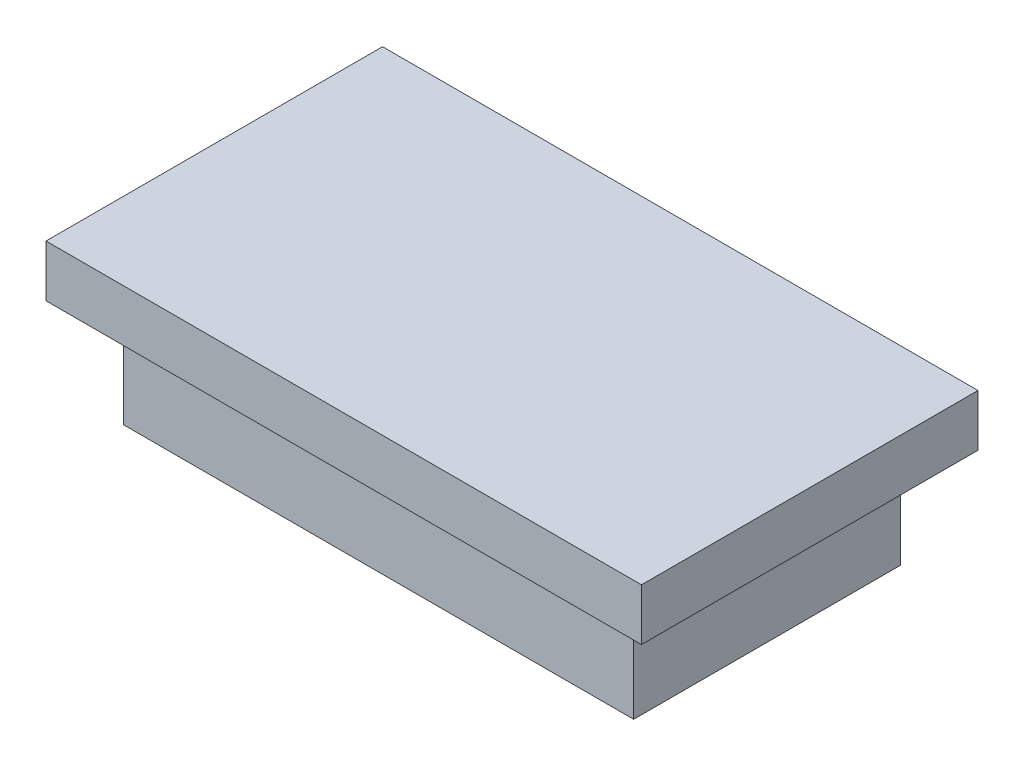
ISO-10303-21;
HEADER;
FILE_DESCRIPTION(('STEP AP214'),'2;1');
FILE_NAME('part.step','',(''),(''),'','','');
FILE_SCHEMA(('AUTOMOTIVE_DESIGN { 1 0 10303 214 1 1 1 1 }'));
ENDSEC;
DATA;
#1=APPLICATION_CONTEXT('core data for automotive mechanical design processes');
#2=APPLICATION_PROTOCOL_DEFINITION('international standard','automotive_design',2000,#1);
#3=PRODUCT_CONTEXT('',#1,'mechanical');
#4=PRODUCT('Part','Part','',(#3));
#5=PRODUCT_RELATED_PRODUCT_CATEGORY('part','',(#4));
#6=PRODUCT_DEFINITION_FORMATION('','',#4);
#7=PRODUCT_DEFINITION_CONTEXT('part definition',#1,'design');
#8=PRODUCT_DEFINITION('design','',#6,#7);
#9=PRODUCT_DEFINITION_SHAPE('','',#8);
#10=(LENGTH_UNIT() NAMED_UNIT(*) SI_UNIT(.MILLI.,.METRE.));
#11=(NAMED_UNIT(*) PLANE_ANGLE_UNIT() SI_UNIT($,.RADIAN.));
#12=(NAMED_UNIT(*) SI_UNIT($,.STERADIAN.) SOLID_ANGLE_UNIT());
#13=UNCERTAINTY_MEASURE_WITH_UNIT(LENGTH_MEASURE(1.E-05),#10,'distance_accuracy_value','');
#14=(GEOMETRIC_REPRESENTATION_CONTEXT(3) GLOBAL_UNCERTAINTY_ASSIGNED_CONTEXT((#13)) GLOBAL_UNIT_ASSIGNED_CONTEXT((#10,
#11,#12)) REPRESENTATION_CONTEXT('',''));
#15=CARTESIAN_POINT('',(0.,0.,0.));
#16=DIRECTION('',(0.,0.,1.));
#17=DIRECTION('',(1.,0.,0.));
#18=AXIS2_PLACEMENT_3D('',#15,#16,#17);
#19=CARTESIAN_POINT('',(-9.85,4.,5.15));
#20=DIRECTION('',(1.,0.,0.));
#21=DIRECTION('',(0.,0.,-1.));
#22=AXIS2_PLACEMENT_3D('',#19,#20,#21);
#23=PLANE('',#22);
#24=DIRECTION('',(0.,0.,1.));
#25=VECTOR('',#24,1.);
#26=CARTESIAN_POINT('',(-9.85,0.,5.15));
#27=LINE('',#26,#25);
#28=CARTESIAN_POINT('',(-9.85,0.,-5.15));
#29=VERTEX_POINT('',#28);
#30=CARTESIAN_POINT('',(-9.85,0.,5.15));
#31=VERTEX_POINT('',#30);
#32=EDGE_CURVE('E133',#29,#31,#27,.T.);
#33=ORIENTED_EDGE('',*,*,#32,.T.);
#34=DIRECTION('',(0.,-1.,0.));
#35=VECTOR('',#34,1.);
#36=CARTESIAN_POINT('',(-9.85,4.,5.15));
#37=LINE('',#36,#35);
#38=CARTESIAN_POINT('',(-9.85,4.,5.15));
#39=VERTEX_POINT('',#38);
#40=EDGE_CURVE('E11',#39,#31,#37,.T.);
#41=ORIENTED_EDGE('',*,*,#40,.F.);
#42=DIRECTION('',(0.,0.,1.));
#43=VECTOR('',#42,1.);
#44=CARTESIAN_POINT('',(-9.85,4.,5.15));
#45=LINE('',#44,#43);
#46=CARTESIAN_POINT('',(-9.84999999999999,4.,-5.15));
#47=VERTEX_POINT('',#46);
#48=EDGE_CURVE('E142',#47,#39,#45,.T.);
#49=ORIENTED_EDGE('',*,*,#48,.F.);
#50=DIRECTION('',(0.,-1.,0.));
#51=VECTOR('',#50,1.);
#52=CARTESIAN_POINT('',(-9.85,4.,-5.15));
#53=LINE('',#52,#51);
#54=EDGE_CURVE('E151',#47,#29,#53,.T.);
#55=ORIENTED_EDGE('',*,*,#54,.T.);
#56=EDGE_LOOP('',(#33,#41,#49,#55));
#57=FACE_BOUND('',#56,.T.);
#58=ADVANCED_FACE('F35',(#57),#23,.F.);
#59=CARTESIAN_POINT('',(9.85,4.,5.15));
#60=DIRECTION('',(0.,0.,-1.));
#61=DIRECTION('',(-1.,0.,0.));
#62=AXIS2_PLACEMENT_3D('',#59,#60,#61);
#63=PLANE('',#62);
#64=DIRECTION('',(1.,0.,0.));
#65=VECTOR('',#64,1.);
#66=CARTESIAN_POINT('',(9.85,0.,5.15));
#67=LINE('',#66,#65);
#68=CARTESIAN_POINT('',(9.85,0.,5.15));
#69=VERTEX_POINT('',#68);
#70=EDGE_CURVE('E136',#31,#69,#67,.T.);
#71=ORIENTED_EDGE('',*,*,#70,.T.);
#72=DIRECTION('',(0.,-1.,0.));
#73=VECTOR('',#72,1.);
#74=CARTESIAN_POINT('',(9.85,4.,5.15));
#75=LINE('',#74,#73);
#76=CARTESIAN_POINT('',(9.85,4.,5.15));
#77=VERTEX_POINT('',#76);
#78=EDGE_CURVE('E43',#77,#69,#75,.T.);
#79=ORIENTED_EDGE('',*,*,#78,.F.);
#80=DIRECTION('',(1.,0.,0.));
#81=VECTOR('',#80,1.);
#82=CARTESIAN_POINT('',(9.85,4.,5.15));
#83=LINE('',#82,#81);
#84=EDGE_CURVE('E77',#39,#77,#83,.T.);
#85=ORIENTED_EDGE('',*,*,#84,.F.);
#86=ORIENTED_EDGE('',*,*,#40,.T.);
#87=EDGE_LOOP('',(#71,#79,#85,#86));
#88=FACE_BOUND('',#87,.T.);
#89=ADVANCED_FACE('F177',(#88),#63,.F.);
#90=CARTESIAN_POINT('',(9.85,4.,5.15));
#91=DIRECTION('',(-1.,0.,0.));
#92=DIRECTION('',(0.,0.,1.));
#93=AXIS2_PLACEMENT_3D('',#90,#91,#92);
#94=PLANE('',#93);
#95=DIRECTION('',(0.,0.,-1.));
#96=VECTOR('',#95,1.);
#97=CARTESIAN_POINT('',(9.85,0.,5.15));
#98=LINE('',#97,#96);
#99=CARTESIAN_POINT('',(9.85,0.,-5.15));
#100=VERTEX_POINT('',#99);
#101=EDGE_CURVE('E67',#69,#100,#98,.T.);
#102=ORIENTED_EDGE('',*,*,#101,.T.);
#103=DIRECTION('',(0.,-1.,0.));
#104=VECTOR('',#103,1.);
#105=CARTESIAN_POINT('',(9.85,4.,-5.15));
#106=LINE('',#105,#104);
#107=CARTESIAN_POINT('',(9.85,4.,-5.15));
#108=VERTEX_POINT('',#107);
#109=EDGE_CURVE('E51',#108,#100,#106,.T.);
#110=ORIENTED_EDGE('',*,*,#109,.F.);
#111=DIRECTION('',(0.,0.,-1.));
#112=VECTOR('',#111,1.);
#113=CARTESIAN_POINT('',(9.85,4.,5.15));
#114=LINE('',#113,#112);
#115=EDGE_CURVE('E146',#77,#108,#114,.T.);
#116=ORIENTED_EDGE('',*,*,#115,.F.);
#117=ORIENTED_EDGE('',*,*,#78,.T.);
#118=EDGE_LOOP('',(#102,#110,#116,#117));
#119=FACE_BOUND('',#118,.T.);
#120=ADVANCED_FACE('F157',(#119),#94,.F.);
#121=CARTESIAN_POINT('',(9.85,4.,-5.15));
#122=DIRECTION('',(0.,0.,1.));
#123=DIRECTION('',(1.,0.,0.));
#124=AXIS2_PLACEMENT_3D('',#121,#122,#123);
#125=PLANE('',#124);
#126=DIRECTION('',(-1.,0.,0.));
#127=VECTOR('',#126,1.);
#128=CARTESIAN_POINT('',(9.85,0.,-5.15));
#129=LINE('',#128,#127);
#130=EDGE_CURVE('E72',#100,#29,#129,.T.);
#131=ORIENTED_EDGE('',*,*,#130,.T.);
#132=ORIENTED_EDGE('',*,*,#54,.F.);
#133=DIRECTION('',(-1.,0.,0.));
#134=VECTOR('',#133,1.);
#135=CARTESIAN_POINT('',(9.85,4.,-5.15));
#136=LINE('',#135,#134);
#137=EDGE_CURVE('E149',#108,#47,#136,.T.);
#138=ORIENTED_EDGE('',*,*,#137,.F.);
#139=ORIENTED_EDGE('',*,*,#109,.T.);
#140=EDGE_LOOP('',(#131,#132,#138,#139));
#141=FACE_BOUND('',#140,.T.);
#142=ADVANCED_FACE('F162',(#141),#125,.F.);
#143=CARTESIAN_POINT('',(0.,0.,0.));
#144=DIRECTION('',(0.,1.,0.));
#145=DIRECTION('',(0.,0.,1.));
#146=AXIS2_PLACEMENT_3D('',#143,#144,#145);
#147=PLANE('',#146);
#148=ORIENTED_EDGE('',*,*,#32,.F.);
#149=ORIENTED_EDGE('',*,*,#130,.F.);
#150=ORIENTED_EDGE('',*,*,#101,.F.);
#151=ORIENTED_EDGE('',*,*,#70,.F.);
#152=EDGE_LOOP('',(#148,#149,#150,#151));
#153=FACE_BOUND('',#152,.T.);
#154=ADVANCED_FACE('F160',(#153),#147,.F.);
#155=CARTESIAN_POINT('',(0.,4.,0.));
#156=DIRECTION('',(0.,1.,0.));
#157=DIRECTION('',(0.,0.,1.));
#158=AXIS2_PLACEMENT_3D('',#155,#156,#157);
#159=PLANE('',#158);
#160=DIRECTION('',(0.,0.,1.));
#161=VECTOR('',#160,1.);
#162=CARTESIAN_POINT('',(-11.5,4.,6.5));
#163=LINE('',#162,#161);
#164=CARTESIAN_POINT('',(-11.5,4.,-6.5));
#165=VERTEX_POINT('',#164);
#166=CARTESIAN_POINT('',(-11.5,4.,6.5));
#167=VERTEX_POINT('',#166);
#168=EDGE_CURVE('E132',#165,#167,#163,.T.);
#169=ORIENTED_EDGE('',*,*,#168,.F.);
#170=DIRECTION('',(-1.,0.,0.));
#171=VECTOR('',#170,1.);
#172=CARTESIAN_POINT('',(11.5,4.,-6.5));
#173=LINE('',#172,#171);
#174=CARTESIAN_POINT('',(11.5,4.,-6.5));
#175=VERTEX_POINT('',#174);
#176=EDGE_CURVE('E128',#175,#165,#173,.T.);
#177=ORIENTED_EDGE('',*,*,#176,.F.);
#178=DIRECTION('',(0.,0.,-1.));
#179=VECTOR('',#178,1.);
#180=CARTESIAN_POINT('',(11.5,4.,6.5));
#181=LINE('',#180,#179);
#182=CARTESIAN_POINT('',(11.5,4.,6.5));
#183=VERTEX_POINT('',#182);
#184=EDGE_CURVE('E204',#183,#175,#181,.T.);
#185=ORIENTED_EDGE('',*,*,#184,.F.);
#186=DIRECTION('',(1.,0.,0.));
#187=VECTOR('',#186,1.);
#188=CARTESIAN_POINT('',(11.5,4.,6.5));
#189=LINE('',#188,#187);
#190=EDGE_CURVE('E207',#167,#183,#189,.T.);
#191=ORIENTED_EDGE('',*,*,#190,.F.);
#192=EDGE_LOOP('',(#169,#177,#185,#191));
#193=FACE_BOUND('',#192,.T.);
#194=ORIENTED_EDGE('',*,*,#137,.T.);
#195=ORIENTED_EDGE('',*,*,#48,.T.);
#196=ORIENTED_EDGE('',*,*,#84,.T.);
#197=ORIENTED_EDGE('',*,*,#115,.T.);
#198=EDGE_LOOP('',(#194,#195,#196,#197));
#199=FACE_BOUND('',#198,.T.);
#200=ADVANCED_FACE('F164',(#193,#199),#159,.F.);
#201=CARTESIAN_POINT('',(-11.5,6.,6.5));
#202=DIRECTION('',(1.,0.,0.));
#203=DIRECTION('',(0.,0.,-1.));
#204=AXIS2_PLACEMENT_3D('',#201,#202,#203);
#205=PLANE('',#204);
#206=ORIENTED_EDGE('',*,*,#168,.T.);
#207=DIRECTION('',(0.,-1.,0.));
#208=VECTOR('',#207,1.);
#209=CARTESIAN_POINT('',(-11.5,6.,6.5));
#210=LINE('',#209,#208);
#211=CARTESIAN_POINT('',(-11.5,6.,6.5));
#212=VERTEX_POINT('',#211);
#213=EDGE_CURVE('E112',#212,#167,#210,.T.);
#214=ORIENTED_EDGE('',*,*,#213,.F.);
#215=DIRECTION('',(0.,0.,1.));
#216=VECTOR('',#215,1.);
#217=CARTESIAN_POINT('',(-11.5,6.,6.5));
#218=LINE('',#217,#216);
#219=CARTESIAN_POINT('',(-11.5,6.,-6.5));
#220=VERTEX_POINT('',#219);
#221=EDGE_CURVE('E119',#220,#212,#218,.T.);
#222=ORIENTED_EDGE('',*,*,#221,.F.);
#223=DIRECTION('',(0.,-1.,0.));
#224=VECTOR('',#223,1.);
#225=CARTESIAN_POINT('',(-11.5,6.,-6.5));
#226=LINE('',#225,#224);
#227=EDGE_CURVE('E201',#220,#165,#226,.T.);
#228=ORIENTED_EDGE('',*,*,#227,.T.);
#229=EDGE_LOOP('',(#206,#214,#222,#228));
#230=FACE_BOUND('',#229,.T.);
#231=ADVANCED_FACE('F130',(#230),#205,.F.);
#232=CARTESIAN_POINT('',(11.5,6.,6.5));
#233=DIRECTION('',(0.,0.,-1.));
#234=DIRECTION('',(-1.,0.,0.));
#235=AXIS2_PLACEMENT_3D('',#232,#233,#234);
#236=PLANE('',#235);
#237=ORIENTED_EDGE('',*,*,#190,.T.);
#238=DIRECTION('',(0.,-1.,0.));
#239=VECTOR('',#238,1.);
#240=CARTESIAN_POINT('',(11.5,6.,6.5));
#241=LINE('',#240,#239);
#242=CARTESIAN_POINT('',(11.5,6.,6.5));
#243=VERTEX_POINT('',#242);
#244=EDGE_CURVE('E115',#243,#183,#241,.T.);
#245=ORIENTED_EDGE('',*,*,#244,.F.);
#246=DIRECTION('',(1.,0.,0.));
#247=VECTOR('',#246,1.);
#248=CARTESIAN_POINT('',(11.5,6.,6.5));
#249=LINE('',#248,#247);
#250=EDGE_CURVE('E108',#212,#243,#249,.T.);
#251=ORIENTED_EDGE('',*,*,#250,.F.);
#252=ORIENTED_EDGE('',*,*,#213,.T.);
#253=EDGE_LOOP('',(#237,#245,#251,#252));
#254=FACE_BOUND('',#253,.T.);
#255=ADVANCED_FACE('F110',(#254),#236,.F.);
#256=CARTESIAN_POINT('',(11.5,6.,6.5));
#257=DIRECTION('',(-1.,0.,0.));
#258=DIRECTION('',(0.,0.,1.));
#259=AXIS2_PLACEMENT_3D('',#256,#257,#258);
#260=PLANE('',#259);
#261=ORIENTED_EDGE('',*,*,#184,.T.);
#262=DIRECTION('',(0.,-1.,0.));
#263=VECTOR('',#262,1.);
#264=CARTESIAN_POINT('',(11.5,6.,-6.5));
#265=LINE('',#264,#263);
#266=CARTESIAN_POINT('',(11.5,6.,-6.5));
#267=VERTEX_POINT('',#266);
#268=EDGE_CURVE('E138',#267,#175,#265,.T.);
#269=ORIENTED_EDGE('',*,*,#268,.F.);
#270=DIRECTION('',(0.,0.,-1.));
#271=VECTOR('',#270,1.);
#272=CARTESIAN_POINT('',(11.5,6.,6.5));
#273=LINE('',#272,#271);
#274=EDGE_CURVE('E118',#243,#267,#273,.T.);
#275=ORIENTED_EDGE('',*,*,#274,.F.);
#276=ORIENTED_EDGE('',*,*,#244,.T.);
#277=EDGE_LOOP('',(#261,#269,#275,#276));
#278=FACE_BOUND('',#277,.T.);
#279=ADVANCED_FACE('F190',(#278),#260,.F.);
#280=CARTESIAN_POINT('',(11.5,6.,-6.5));
#281=DIRECTION('',(0.,0.,1.));
#282=DIRECTION('',(1.,0.,0.));
#283=AXIS2_PLACEMENT_3D('',#280,#281,#282);
#284=PLANE('',#283);
#285=ORIENTED_EDGE('',*,*,#176,.T.);
#286=ORIENTED_EDGE('',*,*,#227,.F.);
#287=DIRECTION('',(-1.,0.,0.));
#288=VECTOR('',#287,1.);
#289=CARTESIAN_POINT('',(11.5,6.,-6.5));
#290=LINE('',#289,#288);
#291=EDGE_CURVE('E124',#267,#220,#290,.T.);
#292=ORIENTED_EDGE('',*,*,#291,.F.);
#293=ORIENTED_EDGE('',*,*,#268,.T.);
#294=EDGE_LOOP('',(#285,#286,#292,#293));
#295=FACE_BOUND('',#294,.T.);
#296=ADVANCED_FACE('F192',(#295),#284,.F.);
#297=CARTESIAN_POINT('',(0.,6.,0.));
#298=DIRECTION('',(0.,1.,0.));
#299=DIRECTION('',(0.,0.,1.));
#300=AXIS2_PLACEMENT_3D('',#297,#298,#299);
#301=PLANE('',#300);
#302=ORIENTED_EDGE('',*,*,#221,.T.);
#303=ORIENTED_EDGE('',*,*,#250,.T.);
#304=ORIENTED_EDGE('',*,*,#274,.T.);
#305=ORIENTED_EDGE('',*,*,#291,.T.);
#306=EDGE_LOOP('',(#302,#303,#304,#305));
#307=FACE_BOUND('',#306,.T.);
#308=ADVANCED_FACE('F122',(#307),#301,.T.);
#309=CLOSED_SHELL('',(#58,#89,#120,#142,#154,#200,#231,#255,#279,#296,#308));
#310=MANIFOLD_SOLID_BREP('B2',#309);
#311=ADVANCED_BREP_SHAPE_REPRESENTATION('',(#18,#310),#14);
#312=SHAPE_DEFINITION_REPRESENTATION(#9,#311);
ENDSEC;
END-ISO-10303-21;
